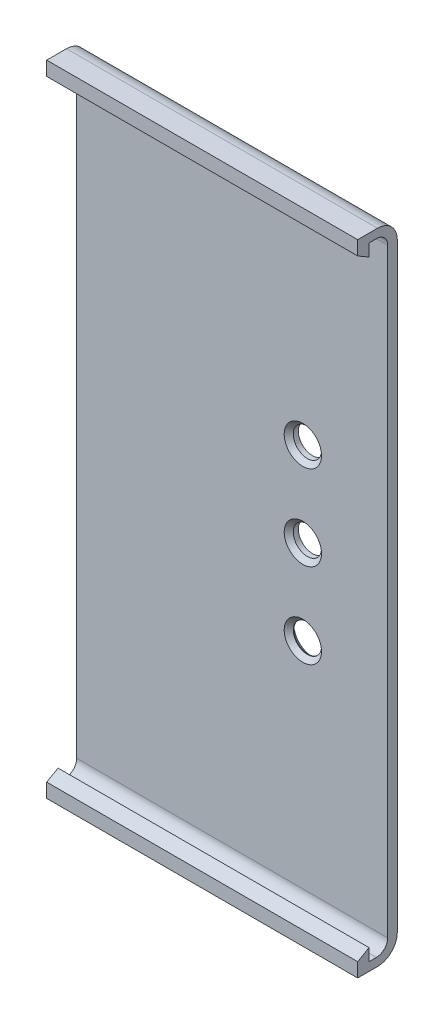
ISO-10303-21;
HEADER;
FILE_DESCRIPTION(('STEP AP214'),'2;1');
FILE_NAME('part.step','',(''),(''),'','','');
FILE_SCHEMA(('AUTOMOTIVE_DESIGN { 1 0 10303 214 1 1 1 1 }'));
ENDSEC;
DATA;
#1=APPLICATION_CONTEXT('core data for automotive mechanical design processes');
#2=APPLICATION_PROTOCOL_DEFINITION('international standard','automotive_design',2000,#1);
#3=PRODUCT_CONTEXT('',#1,'mechanical');
#4=PRODUCT('Part','Part','',(#3));
#5=PRODUCT_RELATED_PRODUCT_CATEGORY('part','',(#4));
#6=PRODUCT_DEFINITION_FORMATION('','',#4);
#7=PRODUCT_DEFINITION_CONTEXT('part definition',#1,'design');
#8=PRODUCT_DEFINITION('design','',#6,#7);
#9=PRODUCT_DEFINITION_SHAPE('','',#8);
#10=(LENGTH_UNIT() NAMED_UNIT(*) SI_UNIT(.MILLI.,.METRE.));
#11=(NAMED_UNIT(*) PLANE_ANGLE_UNIT() SI_UNIT($,.RADIAN.));
#12=(NAMED_UNIT(*) SI_UNIT($,.STERADIAN.) SOLID_ANGLE_UNIT());
#13=UNCERTAINTY_MEASURE_WITH_UNIT(LENGTH_MEASURE(1.E-05),#10,'distance_accuracy_value','');
#14=(GEOMETRIC_REPRESENTATION_CONTEXT(3) GLOBAL_UNCERTAINTY_ASSIGNED_CONTEXT((#13)) GLOBAL_UNIT_ASSIGNED_CONTEXT((#10,
#11,#12)) REPRESENTATION_CONTEXT('',''));
#15=CARTESIAN_POINT('',(0.,0.,0.));
#16=DIRECTION('',(0.,0.,1.));
#17=DIRECTION('',(1.,0.,0.));
#18=AXIS2_PLACEMENT_3D('',#15,#16,#17);
#19=CARTESIAN_POINT('',(55.,113.057885367176,69.7492154476379));
#20=DIRECTION('',(0.,1.,0.));
#21=DIRECTION('',(0.,0.,1.));
#22=AXIS2_PLACEMENT_3D('',#19,#20,#21);
#23=PLANE('',#22);
#24=DIRECTION('',(0.,0.,-1.));
#25=VECTOR('',#24,1.);
#26=CARTESIAN_POINT('',(0.,113.057885367176,69.7492154476379));
#27=LINE('',#26,#25);
#28=CARTESIAN_POINT('',(0.,113.057885367176,69.7492154476379));
#29=VERTEX_POINT('',#28);
#30=CARTESIAN_POINT('',(0.,113.057885367176,68.4492154476379));
#31=VERTEX_POINT('',#30);
#32=EDGE_CURVE('E182',#29,#31,#27,.T.);
#33=ORIENTED_EDGE('',*,*,#32,.T.);
#34=DIRECTION('',(-1.,0.,0.));
#35=VECTOR('',#34,1.);
#36=CARTESIAN_POINT('',(55.,113.057885367176,68.4492154476379));
#37=LINE('',#36,#35);
#38=CARTESIAN_POINT('',(55.,113.057885367176,68.4492154476379));
#39=VERTEX_POINT('',#38);
#40=EDGE_CURVE('E250',#39,#31,#37,.T.);
#41=ORIENTED_EDGE('',*,*,#40,.F.);
#42=DIRECTION('',(0.,0.,-1.));
#43=VECTOR('',#42,1.);
#44=CARTESIAN_POINT('',(55.,113.057885367176,69.7492154476379));
#45=LINE('',#44,#43);
#46=CARTESIAN_POINT('',(55.,113.057885367176,69.7492154476379));
#47=VERTEX_POINT('',#46);
#48=EDGE_CURVE('E213',#47,#39,#45,.T.);
#49=ORIENTED_EDGE('',*,*,#48,.F.);
#50=DIRECTION('',(-1.,0.,0.));
#51=VECTOR('',#50,1.);
#52=CARTESIAN_POINT('',(55.,113.057885367176,69.7492154476379));
#53=LINE('',#52,#51);
#54=EDGE_CURVE('E178',#47,#29,#53,.T.);
#55=ORIENTED_EDGE('',*,*,#54,.T.);
#56=EDGE_LOOP('',(#33,#41,#49,#55));
#57=FACE_BOUND('',#56,.T.);
#58=ADVANCED_FACE('F35',(#57),#23,.F.);
#59=CARTESIAN_POINT('',(55.,111.057885367176,68.4492154476379));
#60=DIRECTION('',(-1.,0.,0.));
#61=DIRECTION('',(0.,0.,1.));
#62=AXIS2_PLACEMENT_3D('',#59,#60,#61);
#63=CYLINDRICAL_SURFACE('',#62,2.00000000000001);
#64=CARTESIAN_POINT('',(0.,111.057885367176,68.4492154476379));
#65=DIRECTION('',(-1.,0.,0.));
#66=DIRECTION('',(0.,0.,-1.));
#67=AXIS2_PLACEMENT_3D('',#64,#65,#66);
#68=CIRCLE('',#67,2.00000000000001);
#69=CARTESIAN_POINT('',(0.,111.057885367176,66.4492154476379));
#70=VERTEX_POINT('',#69);
#71=EDGE_CURVE('E185',#31,#70,#68,.T.);
#72=ORIENTED_EDGE('',*,*,#71,.T.);
#73=DIRECTION('',(-1.,0.,0.));
#74=VECTOR('',#73,1.);
#75=CARTESIAN_POINT('',(55.,111.057885367176,66.4492154476379));
#76=LINE('',#75,#74);
#77=CARTESIAN_POINT('',(55.,111.057885367176,66.4492154476379));
#78=VERTEX_POINT('',#77);
#79=EDGE_CURVE('E247',#78,#70,#76,.T.);
#80=ORIENTED_EDGE('',*,*,#79,.F.);
#81=CARTESIAN_POINT('',(55.,111.057885367176,68.4492154476379));
#82=DIRECTION('',(-1.,0.,0.));
#83=DIRECTION('',(0.,0.,-1.));
#84=AXIS2_PLACEMENT_3D('',#81,#82,#83);
#85=CIRCLE('',#84,2.00000000000001);
#86=EDGE_CURVE('E121',#39,#78,#85,.T.);
#87=ORIENTED_EDGE('',*,*,#86,.F.);
#88=ORIENTED_EDGE('',*,*,#40,.T.);
#89=EDGE_LOOP('',(#72,#80,#87,#88));
#90=FACE_BOUND('',#89,.T.);
#91=ADVANCED_FACE('F290',(#90),#63,.F.);
#92=CARTESIAN_POINT('',(55.,111.057885367176,66.4492154476379));
#93=DIRECTION('',(0.,0.,-1.));
#94=DIRECTION('',(0.,1.,0.));
#95=AXIS2_PLACEMENT_3D('',#92,#93,#94);
#96=PLANE('',#95);
#97=CARTESIAN_POINT('',(40.,42.9736836808163,66.4492154476378));
#98=DIRECTION('',(0.,0.,-1.));
#99=DIRECTION('',(0.,1.,0.));
#100=AXIS2_PLACEMENT_3D('',#97,#98,#99);
#101=CIRCLE('',#100,3.30000000000004);
#102=CARTESIAN_POINT('',(40.,46.2736836808164,66.4492154476378));
#103=VERTEX_POINT('',#102);
#104=EDGE_CURVE('E267',#103,#103,#101,.T.);
#105=ORIENTED_EDGE('',*,*,#104,.T.);
#106=EDGE_LOOP('',(#105));
#107=FACE_BOUND('',#106,.T.);
#108=CARTESIAN_POINT('',(40.,57.9736836808163,66.4492154476378));
#109=DIRECTION('',(0.,0.,-1.));
#110=DIRECTION('',(0.,1.,0.));
#111=AXIS2_PLACEMENT_3D('',#108,#109,#110);
#112=CIRCLE('',#111,3.30000000000003);
#113=CARTESIAN_POINT('',(40.,61.2736836808164,66.4492154476378));
#114=VERTEX_POINT('',#113);
#115=EDGE_CURVE('E264',#114,#114,#112,.T.);
#116=ORIENTED_EDGE('',*,*,#115,.T.);
#117=EDGE_LOOP('',(#116));
#118=FACE_BOUND('',#117,.T.);
#119=CARTESIAN_POINT('',(40.,72.9736836808164,66.4492154476379));
#120=DIRECTION('',(0.,0.,-1.));
#121=DIRECTION('',(0.,1.,0.));
#122=AXIS2_PLACEMENT_3D('',#119,#120,#121);
#123=CIRCLE('',#122,3.30000000000002);
#124=CARTESIAN_POINT('',(40.,76.2736836808164,66.4492154476379));
#125=VERTEX_POINT('',#124);
#126=EDGE_CURVE('E261',#125,#125,#123,.T.);
#127=ORIENTED_EDGE('',*,*,#126,.T.);
#128=EDGE_LOOP('',(#127));
#129=FACE_BOUND('',#128,.T.);
#130=DIRECTION('',(0.,-1.,0.));
#131=VECTOR('',#130,1.);
#132=CARTESIAN_POINT('',(0.,111.057885367176,66.4492154476379));
#133=LINE('',#132,#131);
#134=CARTESIAN_POINT('',(0.,4.97368368081634,66.4492154476378));
#135=VERTEX_POINT('',#134);
#136=EDGE_CURVE('E188',#70,#135,#133,.T.);
#137=ORIENTED_EDGE('',*,*,#136,.T.);
#138=DIRECTION('',(-1.,0.,0.));
#139=VECTOR('',#138,1.);
#140=CARTESIAN_POINT('',(55.,4.97368368081634,66.4492154476378));
#141=LINE('',#140,#139);
#142=CARTESIAN_POINT('',(55.,4.97368368081634,66.4492154476378));
#143=VERTEX_POINT('',#142);
#144=EDGE_CURVE('E244',#143,#135,#141,.T.);
#145=ORIENTED_EDGE('',*,*,#144,.F.);
#146=DIRECTION('',(0.,-1.,0.));
#147=VECTOR('',#146,1.);
#148=CARTESIAN_POINT('',(55.,111.057885367176,66.4492154476379));
#149=LINE('',#148,#147);
#150=EDGE_CURVE('E437',#78,#143,#149,.T.);
#151=ORIENTED_EDGE('',*,*,#150,.F.);
#152=ORIENTED_EDGE('',*,*,#79,.T.);
#153=EDGE_LOOP('',(#137,#145,#151,#152));
#154=FACE_BOUND('',#153,.T.);
#155=ADVANCED_FACE('F296',(#107,#118,#129,#154),#96,.F.);
#156=CARTESIAN_POINT('',(55.,4.97368368081634,68.4492154476378));
#157=DIRECTION('',(-1.,0.,0.));
#158=DIRECTION('',(0.,0.,1.));
#159=AXIS2_PLACEMENT_3D('',#156,#157,#158);
#160=CYLINDRICAL_SURFACE('',#159,2.);
#161=CARTESIAN_POINT('',(0.,4.97368368081634,68.4492154476378));
#162=DIRECTION('',(-1.,0.,0.));
#163=DIRECTION('',(0.,0.,1.));
#164=AXIS2_PLACEMENT_3D('',#161,#162,#163);
#165=CIRCLE('',#164,2.);
#166=CARTESIAN_POINT('',(0.,2.97368368081634,68.4492154476378));
#167=VERTEX_POINT('',#166);
#168=EDGE_CURVE('E190',#135,#167,#165,.T.);
#169=ORIENTED_EDGE('',*,*,#168,.T.);
#170=DIRECTION('',(-1.,0.,0.));
#171=VECTOR('',#170,1.);
#172=CARTESIAN_POINT('',(55.,2.97368368081634,68.4492154476378));
#173=LINE('',#172,#171);
#174=CARTESIAN_POINT('',(55.,2.97368368081634,68.4492154476378));
#175=VERTEX_POINT('',#174);
#176=EDGE_CURVE('E241',#175,#167,#173,.T.);
#177=ORIENTED_EDGE('',*,*,#176,.F.);
#178=CARTESIAN_POINT('',(55.,4.97368368081634,68.4492154476378));
#179=DIRECTION('',(-1.,0.,0.));
#180=DIRECTION('',(0.,0.,1.));
#181=AXIS2_PLACEMENT_3D('',#178,#179,#180);
#182=CIRCLE('',#181,2.);
#183=EDGE_CURVE('E401',#143,#175,#182,.T.);
#184=ORIENTED_EDGE('',*,*,#183,.F.);
#185=ORIENTED_EDGE('',*,*,#144,.T.);
#186=EDGE_LOOP('',(#169,#177,#184,#185));
#187=FACE_BOUND('',#186,.T.);
#188=ADVANCED_FACE('F381',(#187),#160,.F.);
#189=CARTESIAN_POINT('',(55.,2.97368368081634,69.7492154476379));
#190=DIRECTION('',(0.,-1.,0.));
#191=DIRECTION('',(0.,0.,-1.));
#192=AXIS2_PLACEMENT_3D('',#189,#190,#191);
#193=PLANE('',#192);
#194=DIRECTION('',(0.,0.,1.));
#195=VECTOR('',#194,1.);
#196=CARTESIAN_POINT('',(0.,2.97368368081634,69.7492154476379));
#197=LINE('',#196,#195);
#198=CARTESIAN_POINT('',(0.,2.97368368081634,69.7492154476379));
#199=VERTEX_POINT('',#198);
#200=EDGE_CURVE('E192',#167,#199,#197,.T.);
#201=ORIENTED_EDGE('',*,*,#200,.T.);
#202=DIRECTION('',(-1.,0.,0.));
#203=VECTOR('',#202,1.);
#204=CARTESIAN_POINT('',(55.,2.97368368081634,69.7492154476379));
#205=LINE('',#204,#203);
#206=CARTESIAN_POINT('',(55.,2.97368368081634,69.7492154476379));
#207=VERTEX_POINT('',#206);
#208=EDGE_CURVE('E238',#207,#199,#205,.T.);
#209=ORIENTED_EDGE('',*,*,#208,.F.);
#210=DIRECTION('',(0.,0.,1.));
#211=VECTOR('',#210,1.);
#212=CARTESIAN_POINT('',(55.,2.97368368081634,69.7492154476379));
#213=LINE('',#212,#211);
#214=EDGE_CURVE('E413',#175,#207,#213,.T.);
#215=ORIENTED_EDGE('',*,*,#214,.F.);
#216=ORIENTED_EDGE('',*,*,#176,.T.);
#217=EDGE_LOOP('',(#201,#209,#215,#216));
#218=FACE_BOUND('',#217,.T.);
#219=ADVANCED_FACE('F377',(#218),#193,.F.);
#220=CARTESIAN_POINT('',(55.,5.1283842191956,69.7492154476379));
#221=DIRECTION('',(0.,0.,1.));
#222=DIRECTION('',(1.,0.,0.));
#223=AXIS2_PLACEMENT_3D('',#220,#221,#222);
#224=PLANE('',#223);
#225=DIRECTION('',(0.,1.,0.));
#226=VECTOR('',#225,1.);
#227=CARTESIAN_POINT('',(0.,5.1283842191956,69.7492154476379));
#228=LINE('',#227,#226);
#229=CARTESIAN_POINT('',(0.,5.1283842191956,69.7492154476379));
#230=VERTEX_POINT('',#229);
#231=EDGE_CURVE('E194',#199,#230,#228,.T.);
#232=ORIENTED_EDGE('',*,*,#231,.T.);
#233=DIRECTION('',(-1.,0.,0.));
#234=VECTOR('',#233,1.);
#235=CARTESIAN_POINT('',(55.,5.1283842191956,69.7492154476379));
#236=LINE('',#235,#234);
#237=CARTESIAN_POINT('',(55.,5.1283842191956,69.7492154476379));
#238=VERTEX_POINT('',#237);
#239=EDGE_CURVE('E235',#238,#230,#236,.T.);
#240=ORIENTED_EDGE('',*,*,#239,.F.);
#241=DIRECTION('',(0.,1.,0.));
#242=VECTOR('',#241,1.);
#243=CARTESIAN_POINT('',(55.,5.1283842191956,69.7492154476379));
#244=LINE('',#243,#242);
#245=EDGE_CURVE('E410',#207,#238,#244,.T.);
#246=ORIENTED_EDGE('',*,*,#245,.F.);
#247=ORIENTED_EDGE('',*,*,#208,.T.);
#248=EDGE_LOOP('',(#232,#240,#246,#247));
#249=FACE_BOUND('',#248,.T.);
#250=ADVANCED_FACE('F373',(#249),#224,.F.);
#251=CARTESIAN_POINT('',(55.,5.1283842191956,69.7492154476379));
#252=DIRECTION('',(0.,-0.866025403784435,-0.500000000000007));
#253=DIRECTION('',(0.,0.500000000000007,-0.866025403784435));
#254=AXIS2_PLACEMENT_3D('',#251,#252,#253);
#255=PLANE('',#254);
#256=DIRECTION('',(0.,-0.500000000000007,0.866025403784435));
#257=VECTOR('',#256,1.);
#258=CARTESIAN_POINT('',(0.,5.1283842191956,69.7492154476379));
#259=LINE('',#258,#257);
#260=CARTESIAN_POINT('',(0.,3.97368368081635,71.7492154476378));
#261=VERTEX_POINT('',#260);
#262=EDGE_CURVE('E196',#230,#261,#259,.T.);
#263=ORIENTED_EDGE('',*,*,#262,.T.);
#264=DIRECTION('',(-1.,0.,0.));
#265=VECTOR('',#264,1.);
#266=CARTESIAN_POINT('',(55.,3.97368368081635,71.7492154476378));
#267=LINE('',#266,#265);
#268=CARTESIAN_POINT('',(55.,3.97368368081635,71.7492154476378));
#269=VERTEX_POINT('',#268);
#270=EDGE_CURVE('E232',#269,#261,#267,.T.);
#271=ORIENTED_EDGE('',*,*,#270,.F.);
#272=DIRECTION('',(0.,-0.500000000000007,0.866025403784435));
#273=VECTOR('',#272,1.);
#274=CARTESIAN_POINT('',(55.,5.1283842191956,69.7492154476379));
#275=LINE('',#274,#273);
#276=EDGE_CURVE('E412',#238,#269,#275,.T.);
#277=ORIENTED_EDGE('',*,*,#276,.F.);
#278=ORIENTED_EDGE('',*,*,#239,.T.);
#279=EDGE_LOOP('',(#263,#271,#277,#278));
#280=FACE_BOUND('',#279,.T.);
#281=ADVANCED_FACE('F369',(#280),#255,.F.);
#282=CARTESIAN_POINT('',(55.,3.97368368081635,71.7492154476378));
#283=DIRECTION('',(0.,0.,-1.));
#284=DIRECTION('',(-1.,0.,0.));
#285=AXIS2_PLACEMENT_3D('',#282,#283,#284);
#286=PLANE('',#285);
#287=DIRECTION('',(0.,-1.,0.));
#288=VECTOR('',#287,1.);
#289=CARTESIAN_POINT('',(0.,3.97368368081635,71.7492154476378));
#290=LINE('',#289,#288);
#291=CARTESIAN_POINT('',(0.,1.47368368081635,71.7492154476378));
#292=VERTEX_POINT('',#291);
#293=EDGE_CURVE('E198',#261,#292,#290,.T.);
#294=ORIENTED_EDGE('',*,*,#293,.T.);
#295=DIRECTION('',(-1.,0.,0.));
#296=VECTOR('',#295,1.);
#297=CARTESIAN_POINT('',(55.,1.47368368081635,71.7492154476378));
#298=LINE('',#297,#296);
#299=CARTESIAN_POINT('',(55.,1.47368368081635,71.7492154476378));
#300=VERTEX_POINT('',#299);
#301=EDGE_CURVE('E229',#300,#292,#298,.T.);
#302=ORIENTED_EDGE('',*,*,#301,.F.);
#303=DIRECTION('',(0.,-1.,0.));
#304=VECTOR('',#303,1.);
#305=CARTESIAN_POINT('',(55.,3.97368368081635,71.7492154476378));
#306=LINE('',#305,#304);
#307=EDGE_CURVE('E415',#269,#300,#306,.T.);
#308=ORIENTED_EDGE('',*,*,#307,.F.);
#309=ORIENTED_EDGE('',*,*,#270,.T.);
#310=EDGE_LOOP('',(#294,#302,#308,#309));
#311=FACE_BOUND('',#310,.T.);
#312=ADVANCED_FACE('F365',(#311),#286,.F.);
#313=CARTESIAN_POINT('',(55.,1.47368368081635,71.7492154476378));
#314=DIRECTION('',(0.,1.,0.));
#315=DIRECTION('',(0.,0.,1.));
#316=AXIS2_PLACEMENT_3D('',#313,#314,#315);
#317=PLANE('',#316);
#318=DIRECTION('',(0.,0.,-1.));
#319=VECTOR('',#318,1.);
#320=CARTESIAN_POINT('',(0.,1.47368368081635,71.7492154476378));
#321=LINE('',#320,#319);
#322=CARTESIAN_POINT('',(0.,1.47368368081634,68.2492154476379));
#323=VERTEX_POINT('',#322);
#324=EDGE_CURVE('E200',#292,#323,#321,.T.);
#325=ORIENTED_EDGE('',*,*,#324,.T.);
#326=DIRECTION('',(-1.,0.,0.));
#327=VECTOR('',#326,1.);
#328=CARTESIAN_POINT('',(55.,1.47368368081634,68.2492154476379));
#329=LINE('',#328,#327);
#330=CARTESIAN_POINT('',(55.,1.47368368081634,68.2492154476379));
#331=VERTEX_POINT('',#330);
#332=EDGE_CURVE('E226',#331,#323,#329,.T.);
#333=ORIENTED_EDGE('',*,*,#332,.F.);
#334=DIRECTION('',(0.,0.,-1.));
#335=VECTOR('',#334,1.);
#336=CARTESIAN_POINT('',(55.,1.47368368081635,71.7492154476378));
#337=LINE('',#336,#335);
#338=EDGE_CURVE('E421',#300,#331,#337,.T.);
#339=ORIENTED_EDGE('',*,*,#338,.F.);
#340=ORIENTED_EDGE('',*,*,#301,.T.);
#341=EDGE_LOOP('',(#325,#333,#339,#340));
#342=FACE_BOUND('',#341,.T.);
#343=ADVANCED_FACE('F361',(#342),#317,.F.);
#344=CARTESIAN_POINT('',(55.,4.97368368081634,68.2492154476379));
#345=DIRECTION('',(-1.,0.,0.));
#346=DIRECTION('',(0.,0.,1.));
#347=AXIS2_PLACEMENT_3D('',#344,#345,#346);
#348=CYLINDRICAL_SURFACE('',#347,3.5);
#349=CARTESIAN_POINT('',(0.,4.97368368081634,68.2492154476379));
#350=DIRECTION('',(1.,0.,0.));
#351=DIRECTION('',(0.,0.,1.));
#352=AXIS2_PLACEMENT_3D('',#349,#350,#351);
#353=CIRCLE('',#352,3.5);
#354=CARTESIAN_POINT('',(0.,4.97368368081634,64.7492154476379));
#355=VERTEX_POINT('',#354);
#356=EDGE_CURVE('E202',#323,#355,#353,.T.);
#357=ORIENTED_EDGE('',*,*,#356,.T.);
#358=DIRECTION('',(-1.,0.,0.));
#359=VECTOR('',#358,1.);
#360=CARTESIAN_POINT('',(55.,4.97368368081634,64.7492154476379));
#361=LINE('',#360,#359);
#362=CARTESIAN_POINT('',(55.,4.97368368081634,64.7492154476379));
#363=VERTEX_POINT('',#362);
#364=EDGE_CURVE('E223',#363,#355,#361,.T.);
#365=ORIENTED_EDGE('',*,*,#364,.F.);
#366=CARTESIAN_POINT('',(55.,4.97368368081634,68.2492154476379));
#367=DIRECTION('',(1.,0.,0.));
#368=DIRECTION('',(0.,0.,1.));
#369=AXIS2_PLACEMENT_3D('',#366,#367,#368);
#370=CIRCLE('',#369,3.5);
#371=EDGE_CURVE('E423',#331,#363,#370,.T.);
#372=ORIENTED_EDGE('',*,*,#371,.F.);
#373=ORIENTED_EDGE('',*,*,#332,.T.);
#374=EDGE_LOOP('',(#357,#365,#372,#373));
#375=FACE_BOUND('',#374,.T.);
#376=ADVANCED_FACE('F357',(#375),#348,.T.);
#377=CARTESIAN_POINT('',(55.,4.97368368081634,64.7492154476379));
#378=DIRECTION('',(0.,0.,1.));
#379=DIRECTION('',(0.,-1.,0.));
#380=AXIS2_PLACEMENT_3D('',#377,#378,#379);
#381=PLANE('',#380);
#382=CARTESIAN_POINT('',(40.,42.9736836808163,64.7492154476379));
#383=DIRECTION('',(0.,0.,1.));
#384=DIRECTION('',(0.,-1.,0.));
#385=AXIS2_PLACEMENT_3D('',#382,#383,#384);
#386=CIRCLE('',#385,3.3);
#387=CARTESIAN_POINT('',(40.,39.6736836808163,64.7492154476379));
#388=VERTEX_POINT('',#387);
#389=EDGE_CURVE('E258',#388,#388,#386,.T.);
#390=ORIENTED_EDGE('',*,*,#389,.T.);
#391=EDGE_LOOP('',(#390));
#392=FACE_BOUND('',#391,.T.);
#393=CARTESIAN_POINT('',(40.,72.9736836808164,64.7492154476379));
#394=DIRECTION('',(0.,0.,1.));
#395=DIRECTION('',(0.,-1.,0.));
#396=AXIS2_PLACEMENT_3D('',#393,#394,#395);
#397=CIRCLE('',#396,2.5);
#398=CARTESIAN_POINT('',(40.,70.4736836808163,64.7492154476379));
#399=VERTEX_POINT('',#398);
#400=EDGE_CURVE('E186',#399,#399,#397,.F.);
#401=ORIENTED_EDGE('',*,*,#400,.F.);
#402=EDGE_LOOP('',(#401));
#403=FACE_BOUND('',#402,.T.);
#404=CARTESIAN_POINT('',(40.,57.9736836808163,64.7492154476379));
#405=DIRECTION('',(0.,0.,1.));
#406=DIRECTION('',(0.,-1.,0.));
#407=AXIS2_PLACEMENT_3D('',#404,#405,#406);
#408=CIRCLE('',#407,2.5);
#409=CARTESIAN_POINT('',(40.,55.4736836808163,64.7492154476379));
#410=VERTEX_POINT('',#409);
#411=EDGE_CURVE('E440',#410,#410,#408,.F.);
#412=ORIENTED_EDGE('',*,*,#411,.F.);
#413=EDGE_LOOP('',(#412));
#414=FACE_BOUND('',#413,.T.);
#415=DIRECTION('',(0.,1.,0.));
#416=VECTOR('',#415,1.);
#417=CARTESIAN_POINT('',(0.,4.97368368081634,64.7492154476379));
#418=LINE('',#417,#416);
#419=CARTESIAN_POINT('',(0.,111.057885367176,64.7492154476379));
#420=VERTEX_POINT('',#419);
#421=EDGE_CURVE('E204',#355,#420,#418,.T.);
#422=ORIENTED_EDGE('',*,*,#421,.T.);
#423=DIRECTION('',(-1.,0.,0.));
#424=VECTOR('',#423,1.);
#425=CARTESIAN_POINT('',(55.,111.057885367176,64.7492154476379));
#426=LINE('',#425,#424);
#427=CARTESIAN_POINT('',(55.,111.057885367176,64.7492154476379));
#428=VERTEX_POINT('',#427);
#429=EDGE_CURVE('E220',#428,#420,#426,.T.);
#430=ORIENTED_EDGE('',*,*,#429,.F.);
#431=DIRECTION('',(0.,1.,0.));
#432=VECTOR('',#431,1.);
#433=CARTESIAN_POINT('',(55.,4.97368368081634,64.7492154476379));
#434=LINE('',#433,#432);
#435=EDGE_CURVE('E425',#363,#428,#434,.T.);
#436=ORIENTED_EDGE('',*,*,#435,.F.);
#437=ORIENTED_EDGE('',*,*,#364,.T.);
#438=EDGE_LOOP('',(#422,#430,#436,#437));
#439=FACE_BOUND('',#438,.T.);
#440=ADVANCED_FACE('F353',(#392,#403,#414,#439),#381,.F.);
#441=CARTESIAN_POINT('',(55.,111.057885367176,68.2492154476379));
#442=DIRECTION('',(-1.,0.,0.));
#443=DIRECTION('',(0.,0.,1.));
#444=AXIS2_PLACEMENT_3D('',#441,#442,#443);
#445=CYLINDRICAL_SURFACE('',#444,3.50000000000002);
#446=CARTESIAN_POINT('',(0.,111.057885367176,68.2492154476379));
#447=DIRECTION('',(1.,0.,0.));
#448=DIRECTION('',(0.,0.,1.));
#449=AXIS2_PLACEMENT_3D('',#446,#447,#448);
#450=CIRCLE('',#449,3.50000000000002);
#451=CARTESIAN_POINT('',(0.,114.557885367176,68.2492154476379));
#452=VERTEX_POINT('',#451);
#453=EDGE_CURVE('E206',#420,#452,#450,.T.);
#454=ORIENTED_EDGE('',*,*,#453,.T.);
#455=DIRECTION('',(-1.,0.,0.));
#456=VECTOR('',#455,1.);
#457=CARTESIAN_POINT('',(55.,114.557885367176,68.2492154476379));
#458=LINE('',#457,#456);
#459=CARTESIAN_POINT('',(55.,114.557885367176,68.2492154476379));
#460=VERTEX_POINT('',#459);
#461=EDGE_CURVE('E217',#460,#452,#458,.T.);
#462=ORIENTED_EDGE('',*,*,#461,.F.);
#463=CARTESIAN_POINT('',(55.,111.057885367176,68.2492154476379));
#464=DIRECTION('',(1.,0.,0.));
#465=DIRECTION('',(0.,0.,1.));
#466=AXIS2_PLACEMENT_3D('',#463,#464,#465);
#467=CIRCLE('',#466,3.50000000000002);
#468=EDGE_CURVE('E427',#428,#460,#467,.T.);
#469=ORIENTED_EDGE('',*,*,#468,.F.);
#470=ORIENTED_EDGE('',*,*,#429,.T.);
#471=EDGE_LOOP('',(#454,#462,#469,#470));
#472=FACE_BOUND('',#471,.T.);
#473=ADVANCED_FACE('F349',(#472),#445,.T.);
#474=CARTESIAN_POINT('',(55.,114.557885367176,68.2492154476379));
#475=DIRECTION('',(0.,-1.,0.));
#476=DIRECTION('',(0.,0.,-1.));
#477=AXIS2_PLACEMENT_3D('',#474,#475,#476);
#478=PLANE('',#477);
#479=DIRECTION('',(0.,0.,1.));
#480=VECTOR('',#479,1.);
#481=CARTESIAN_POINT('',(0.,114.557885367176,68.2492154476379));
#482=LINE('',#481,#480);
#483=CARTESIAN_POINT('',(0.,114.557885367176,71.7492154476378));
#484=VERTEX_POINT('',#483);
#485=EDGE_CURVE('E208',#452,#484,#482,.T.);
#486=ORIENTED_EDGE('',*,*,#485,.T.);
#487=DIRECTION('',(-1.,0.,0.));
#488=VECTOR('',#487,1.);
#489=CARTESIAN_POINT('',(55.,114.557885367176,71.7492154476378));
#490=LINE('',#489,#488);
#491=CARTESIAN_POINT('',(55.,114.557885367176,71.7492154476378));
#492=VERTEX_POINT('',#491);
#493=EDGE_CURVE('E173',#492,#484,#490,.T.);
#494=ORIENTED_EDGE('',*,*,#493,.F.);
#495=DIRECTION('',(0.,0.,1.));
#496=VECTOR('',#495,1.);
#497=CARTESIAN_POINT('',(55.,114.557885367176,68.2492154476379));
#498=LINE('',#497,#496);
#499=EDGE_CURVE('E164',#460,#492,#498,.T.);
#500=ORIENTED_EDGE('',*,*,#499,.F.);
#501=ORIENTED_EDGE('',*,*,#461,.T.);
#502=EDGE_LOOP('',(#486,#494,#500,#501));
#503=FACE_BOUND('',#502,.T.);
#504=ADVANCED_FACE('F346',(#503),#478,.F.);
#505=CARTESIAN_POINT('',(55.,114.557885367176,71.7492154476378));
#506=DIRECTION('',(0.,0.,-1.));
#507=DIRECTION('',(0.,1.,0.));
#508=AXIS2_PLACEMENT_3D('',#505,#506,#507);
#509=PLANE('',#508);
#510=DIRECTION('',(0.,-1.,0.));
#511=VECTOR('',#510,1.);
#512=CARTESIAN_POINT('',(0.,114.557885367176,71.7492154476378));
#513=LINE('',#512,#511);
#514=CARTESIAN_POINT('',(0.,112.057885367176,71.7492154476379));
#515=VERTEX_POINT('',#514);
#516=EDGE_CURVE('E172',#484,#515,#513,.T.);
#517=ORIENTED_EDGE('',*,*,#516,.T.);
#518=DIRECTION('',(-1.,0.,0.));
#519=VECTOR('',#518,1.);
#520=CARTESIAN_POINT('',(55.,112.057885367176,71.7492154476379));
#521=LINE('',#520,#519);
#522=CARTESIAN_POINT('',(55.,112.057885367176,71.7492154476379));
#523=VERTEX_POINT('',#522);
#524=EDGE_CURVE('E169',#523,#515,#521,.T.);
#525=ORIENTED_EDGE('',*,*,#524,.F.);
#526=DIRECTION('',(0.,-1.,0.));
#527=VECTOR('',#526,1.);
#528=CARTESIAN_POINT('',(55.,114.557885367176,71.7492154476378));
#529=LINE('',#528,#527);
#530=EDGE_CURVE('E158',#492,#523,#529,.T.);
#531=ORIENTED_EDGE('',*,*,#530,.F.);
#532=ORIENTED_EDGE('',*,*,#493,.T.);
#533=EDGE_LOOP('',(#517,#525,#531,#532));
#534=FACE_BOUND('',#533,.T.);
#535=ADVANCED_FACE('F170',(#534),#509,.F.);
#536=CARTESIAN_POINT('',(55.,110.903184828797,69.7492154476379));
#537=DIRECTION('',(0.,0.866025403784441,-0.499999999999996));
#538=DIRECTION('',(0.,0.499999999999995,0.866025403784441));
#539=AXIS2_PLACEMENT_3D('',#536,#537,#538);
#540=PLANE('',#539);
#541=DIRECTION('',(0.,-0.499999999999996,-0.866025403784441));
#542=VECTOR('',#541,1.);
#543=CARTESIAN_POINT('',(0.,110.903184828797,69.7492154476379));
#544=LINE('',#543,#542);
#545=CARTESIAN_POINT('',(0.,110.903184828797,69.7492154476379));
#546=VERTEX_POINT('',#545);
#547=EDGE_CURVE('E106',#515,#546,#544,.T.);
#548=ORIENTED_EDGE('',*,*,#547,.T.);
#549=DIRECTION('',(-1.,0.,0.));
#550=VECTOR('',#549,1.);
#551=CARTESIAN_POINT('',(55.,110.903184828797,69.7492154476379));
#552=LINE('',#551,#550);
#553=CARTESIAN_POINT('',(55.,110.903184828797,69.7492154476379));
#554=VERTEX_POINT('',#553);
#555=EDGE_CURVE('E174',#554,#546,#552,.T.);
#556=ORIENTED_EDGE('',*,*,#555,.F.);
#557=DIRECTION('',(0.,-0.499999999999996,-0.866025403784441));
#558=VECTOR('',#557,1.);
#559=CARTESIAN_POINT('',(55.,110.903184828797,69.7492154476379));
#560=LINE('',#559,#558);
#561=EDGE_CURVE('E162',#523,#554,#560,.T.);
#562=ORIENTED_EDGE('',*,*,#561,.F.);
#563=ORIENTED_EDGE('',*,*,#524,.T.);
#564=EDGE_LOOP('',(#548,#556,#562,#563));
#565=FACE_BOUND('',#564,.T.);
#566=ADVANCED_FACE('F176',(#565),#540,.F.);
#567=CARTESIAN_POINT('',(55.,110.903184828797,69.7492154476379));
#568=DIRECTION('',(0.,0.,1.));
#569=DIRECTION('',(1.,0.,0.));
#570=AXIS2_PLACEMENT_3D('',#567,#568,#569);
#571=PLANE('',#570);
#572=DIRECTION('',(0.,1.,0.));
#573=VECTOR('',#572,1.);
#574=CARTESIAN_POINT('',(0.,110.903184828797,69.7492154476379));
#575=LINE('',#574,#573);
#576=EDGE_CURVE('E112',#546,#29,#575,.T.);
#577=ORIENTED_EDGE('',*,*,#576,.T.);
#578=ORIENTED_EDGE('',*,*,#54,.F.);
#579=DIRECTION('',(0.,1.,0.));
#580=VECTOR('',#579,1.);
#581=CARTESIAN_POINT('',(55.,110.903184828797,69.7492154476379));
#582=LINE('',#581,#580);
#583=EDGE_CURVE('E53',#554,#47,#582,.T.);
#584=ORIENTED_EDGE('',*,*,#583,.F.);
#585=ORIENTED_EDGE('',*,*,#555,.T.);
#586=EDGE_LOOP('',(#577,#578,#584,#585));
#587=FACE_BOUND('',#586,.T.);
#588=ADVANCED_FACE('F338',(#587),#571,.F.);
#589=CARTESIAN_POINT('',(55.,111.057885367176,68.4492154476379));
#590=DIRECTION('',(1.,0.,0.));
#591=DIRECTION('',(0.,0.,-1.));
#592=AXIS2_PLACEMENT_3D('',#589,#590,#591);
#593=PLANE('',#592);
#594=ORIENTED_EDGE('',*,*,#48,.T.);
#595=ORIENTED_EDGE('',*,*,#86,.T.);
#596=ORIENTED_EDGE('',*,*,#150,.T.);
#597=ORIENTED_EDGE('',*,*,#183,.T.);
#598=ORIENTED_EDGE('',*,*,#214,.T.);
#599=ORIENTED_EDGE('',*,*,#245,.T.);
#600=ORIENTED_EDGE('',*,*,#276,.T.);
#601=ORIENTED_EDGE('',*,*,#307,.T.);
#602=ORIENTED_EDGE('',*,*,#338,.T.);
#603=ORIENTED_EDGE('',*,*,#371,.T.);
#604=ORIENTED_EDGE('',*,*,#435,.T.);
#605=ORIENTED_EDGE('',*,*,#468,.T.);
#606=ORIENTED_EDGE('',*,*,#499,.T.);
#607=ORIENTED_EDGE('',*,*,#530,.T.);
#608=ORIENTED_EDGE('',*,*,#561,.T.);
#609=ORIENTED_EDGE('',*,*,#583,.T.);
#610=EDGE_LOOP('',(#594,#595,#596,#597,#598,#599,#600,#601,#602,#603,#604,#605,#606,#607,#608,#609));
#611=FACE_BOUND('',#610,.T.);
#612=ADVANCED_FACE('F160',(#611),#593,.T.);
#613=CARTESIAN_POINT('',(0.,111.057885367176,68.4492154476379));
#614=DIRECTION('',(1.,0.,0.));
#615=DIRECTION('',(0.,0.,-1.));
#616=AXIS2_PLACEMENT_3D('',#613,#614,#615);
#617=PLANE('',#616);
#618=ORIENTED_EDGE('',*,*,#32,.F.);
#619=ORIENTED_EDGE('',*,*,#576,.F.);
#620=ORIENTED_EDGE('',*,*,#547,.F.);
#621=ORIENTED_EDGE('',*,*,#516,.F.);
#622=ORIENTED_EDGE('',*,*,#485,.F.);
#623=ORIENTED_EDGE('',*,*,#453,.F.);
#624=ORIENTED_EDGE('',*,*,#421,.F.);
#625=ORIENTED_EDGE('',*,*,#356,.F.);
#626=ORIENTED_EDGE('',*,*,#324,.F.);
#627=ORIENTED_EDGE('',*,*,#293,.F.);
#628=ORIENTED_EDGE('',*,*,#262,.F.);
#629=ORIENTED_EDGE('',*,*,#231,.F.);
#630=ORIENTED_EDGE('',*,*,#200,.F.);
#631=ORIENTED_EDGE('',*,*,#168,.F.);
#632=ORIENTED_EDGE('',*,*,#136,.F.);
#633=ORIENTED_EDGE('',*,*,#71,.F.);
#634=EDGE_LOOP('',(#618,#619,#620,#621,#622,#623,#624,#625,#626,#627,#628,#629,#630,#631,#632,#633));
#635=FACE_BOUND('',#634,.T.);
#636=ADVANCED_FACE('F325',(#635),#617,.F.);
#637=CARTESIAN_POINT('',(40.,42.9736836808163,64.7482154476379));
#638=DIRECTION('',(0.,0.,1.));
#639=DIRECTION('',(1.,0.,0.));
#640=AXIS2_PLACEMENT_3D('',#637,#638,#639);
#641=CYLINDRICAL_SURFACE('',#640,2.5);
#642=CARTESIAN_POINT('',(40.,42.9736836808163,65.5492154476379));
#643=DIRECTION('',(0.,0.,1.));
#644=DIRECTION('',(1.,0.,0.));
#645=AXIS2_PLACEMENT_3D('',#642,#643,#644);
#646=CIRCLE('',#645,2.5);
#647=CARTESIAN_POINT('',(42.5,42.9736836808163,65.5492154476379));
#648=VERTEX_POINT('',#647);
#649=EDGE_CURVE('E255',#648,#648,#646,.F.);
#650=ORIENTED_EDGE('',*,*,#649,.T.);
#651=EDGE_LOOP('',(#650));
#652=FACE_BOUND('',#651,.T.);
#653=CARTESIAN_POINT('',(40.,42.9736836808163,65.6492154476378));
#654=DIRECTION('',(0.,0.,-1.));
#655=DIRECTION('',(-1.,0.,0.));
#656=AXIS2_PLACEMENT_3D('',#653,#654,#655);
#657=CIRCLE('',#656,2.5);
#658=CARTESIAN_POINT('',(37.5,42.9736836808163,65.6492154476378));
#659=VERTEX_POINT('',#658);
#660=EDGE_CURVE('E252',#659,#659,#657,.F.);
#661=ORIENTED_EDGE('',*,*,#660,.T.);
#662=EDGE_LOOP('',(#661));
#663=FACE_BOUND('',#662,.T.);
#664=ADVANCED_FACE('F322',(#652,#663),#641,.F.);
#665=CARTESIAN_POINT('',(40.,57.9736836808163,64.7482154476379));
#666=DIRECTION('',(0.,0.,1.));
#667=DIRECTION('',(1.,0.,0.));
#668=AXIS2_PLACEMENT_3D('',#665,#666,#667);
#669=CYLINDRICAL_SURFACE('',#668,2.5);
#670=CARTESIAN_POINT('',(40.,57.9736836808163,65.6492154476378));
#671=DIRECTION('',(0.,0.,-1.));
#672=DIRECTION('',(-1.,0.,0.));
#673=AXIS2_PLACEMENT_3D('',#670,#671,#672);
#674=CIRCLE('',#673,2.5);
#675=CARTESIAN_POINT('',(37.5,57.9736836808163,65.6492154476378));
#676=VERTEX_POINT('',#675);
#677=EDGE_CURVE('E45',#676,#676,#674,.F.);
#678=ORIENTED_EDGE('',*,*,#677,.T.);
#679=EDGE_LOOP('',(#678));
#680=FACE_BOUND('',#679,.T.);
#681=ORIENTED_EDGE('',*,*,#411,.T.);
#682=EDGE_LOOP('',(#681));
#683=FACE_BOUND('',#682,.T.);
#684=ADVANCED_FACE('F272',(#680,#683),#669,.F.);
#685=CARTESIAN_POINT('',(40.,72.9736836808164,64.7482154476379));
#686=DIRECTION('',(0.,0.,1.));
#687=DIRECTION('',(1.,0.,0.));
#688=AXIS2_PLACEMENT_3D('',#685,#686,#687);
#689=CYLINDRICAL_SURFACE('',#688,2.5);
#690=CARTESIAN_POINT('',(40.,72.9736836808164,65.6492154476378));
#691=DIRECTION('',(0.,0.,-1.));
#692=DIRECTION('',(-1.,0.,0.));
#693=AXIS2_PLACEMENT_3D('',#690,#691,#692);
#694=CIRCLE('',#693,2.5);
#695=CARTESIAN_POINT('',(37.5,72.9736836808164,65.6492154476378));
#696=VERTEX_POINT('',#695);
#697=EDGE_CURVE('E11',#696,#696,#694,.F.);
#698=ORIENTED_EDGE('',*,*,#697,.T.);
#699=EDGE_LOOP('',(#698));
#700=FACE_BOUND('',#699,.T.);
#701=ORIENTED_EDGE('',*,*,#400,.T.);
#702=EDGE_LOOP('',(#701));
#703=FACE_BOUND('',#702,.T.);
#704=ADVANCED_FACE('F305',(#700,#703),#689,.F.);
#705=CARTESIAN_POINT('',(40.,42.9736836808163,65.5492154476379));
#706=DIRECTION('',(0.,0.,-1.));
#707=DIRECTION('',(-1.,0.,0.));
#708=AXIS2_PLACEMENT_3D('',#705,#706,#707);
#709=CONICAL_SURFACE('',#708,2.5,0.785398163397448);
#710=ORIENTED_EDGE('',*,*,#389,.F.);
#711=EDGE_LOOP('',(#710));
#712=FACE_BOUND('',#711,.T.);
#713=ORIENTED_EDGE('',*,*,#649,.F.);
#714=EDGE_LOOP('',(#713));
#715=FACE_BOUND('',#714,.T.);
#716=ADVANCED_FACE('F284',(#712,#715),#709,.F.);
#717=CARTESIAN_POINT('',(40.,42.9736836808163,65.6492154476378));
#718=DIRECTION('',(0.,0.,1.));
#719=DIRECTION('',(1.,0.,0.));
#720=AXIS2_PLACEMENT_3D('',#717,#718,#719);
#721=CONICAL_SURFACE('',#720,2.5,0.785398163397461);
#722=ORIENTED_EDGE('',*,*,#104,.F.);
#723=EDGE_LOOP('',(#722));
#724=FACE_BOUND('',#723,.T.);
#725=ORIENTED_EDGE('',*,*,#660,.F.);
#726=EDGE_LOOP('',(#725));
#727=FACE_BOUND('',#726,.T.);
#728=ADVANCED_FACE('F277',(#724,#727),#721,.F.);
#729=CARTESIAN_POINT('',(40.,57.9736836808163,65.6492154476378));
#730=DIRECTION('',(0.,0.,1.));
#731=DIRECTION('',(1.,0.,0.));
#732=AXIS2_PLACEMENT_3D('',#729,#730,#731);
#733=CONICAL_SURFACE('',#732,2.5,0.785398163397452);
#734=ORIENTED_EDGE('',*,*,#115,.F.);
#735=EDGE_LOOP('',(#734));
#736=FACE_BOUND('',#735,.T.);
#737=ORIENTED_EDGE('',*,*,#677,.F.);
#738=EDGE_LOOP('',(#737));
#739=FACE_BOUND('',#738,.T.);
#740=ADVANCED_FACE('F275',(#736,#739),#733,.F.);
#741=CARTESIAN_POINT('',(40.,72.9736836808164,65.6492154476378));
#742=DIRECTION('',(0.,0.,1.));
#743=DIRECTION('',(1.,0.,0.));
#744=AXIS2_PLACEMENT_3D('',#741,#742,#743);
#745=CONICAL_SURFACE('',#744,2.5,0.785398163397457);
#746=ORIENTED_EDGE('',*,*,#126,.F.);
#747=EDGE_LOOP('',(#746));
#748=FACE_BOUND('',#747,.T.);
#749=ORIENTED_EDGE('',*,*,#697,.F.);
#750=EDGE_LOOP('',(#749));
#751=FACE_BOUND('',#750,.T.);
#752=ADVANCED_FACE('F38',(#748,#751),#745,.F.);
#753=CLOSED_SHELL('',(#58,#91,#155,#188,#219,#250,#281,#312,#343,#376,#440,#473,#504,#535,#566,
#588,#612,#636,#664,#684,#704,#716,#728,#740,#752));
#754=MANIFOLD_SOLID_BREP('B2',#753);
#755=ADVANCED_BREP_SHAPE_REPRESENTATION('',(#18,#754),#14);
#756=SHAPE_DEFINITION_REPRESENTATION(#9,#755);
ENDSEC;
END-ISO-10303-21;
